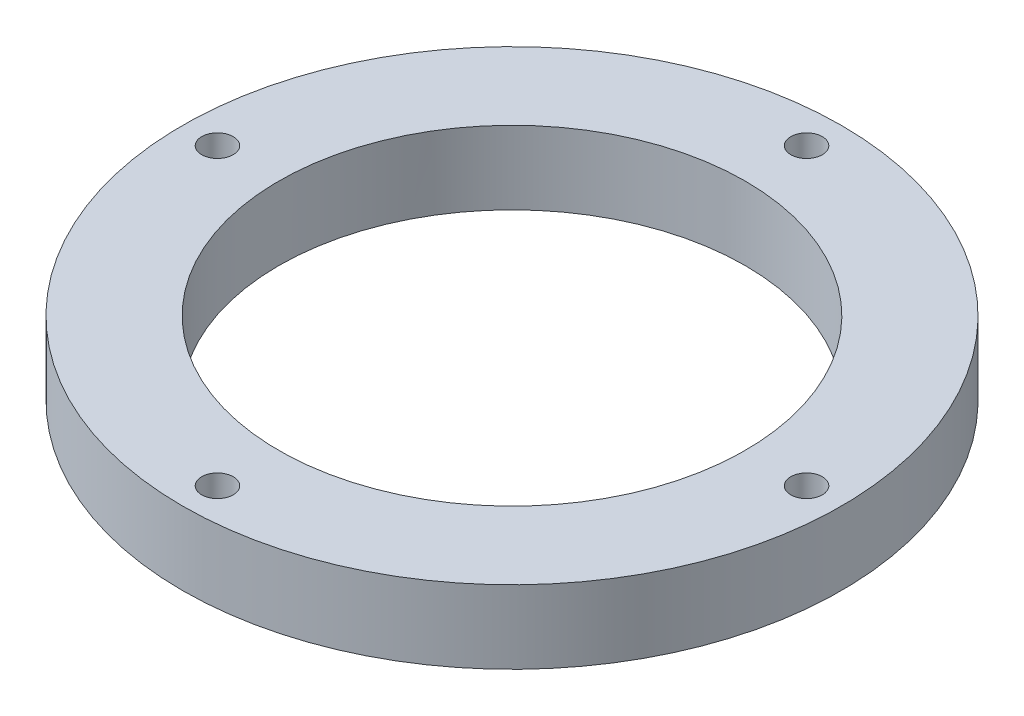
ISO-10303-21;
HEADER;
FILE_DESCRIPTION(('STEP AP214'),'2;1');
FILE_NAME('part.step','',(''),(''),'','','');
FILE_SCHEMA(('AUTOMOTIVE_DESIGN { 1 0 10303 214 1 1 1 1 }'));
ENDSEC;
DATA;
#1=APPLICATION_CONTEXT('core data for automotive mechanical design processes');
#2=APPLICATION_PROTOCOL_DEFINITION('international standard','automotive_design',2000,#1);
#3=PRODUCT_CONTEXT('',#1,'mechanical');
#4=PRODUCT('Part','Part','',(#3));
#5=PRODUCT_RELATED_PRODUCT_CATEGORY('part','',(#4));
#6=PRODUCT_DEFINITION_FORMATION('','',#4);
#7=PRODUCT_DEFINITION_CONTEXT('part definition',#1,'design');
#8=PRODUCT_DEFINITION('design','',#6,#7);
#9=PRODUCT_DEFINITION_SHAPE('','',#8);
#10=(LENGTH_UNIT() NAMED_UNIT(*) SI_UNIT(.MILLI.,.METRE.));
#11=(NAMED_UNIT(*) PLANE_ANGLE_UNIT() SI_UNIT($,.RADIAN.));
#12=(NAMED_UNIT(*) SI_UNIT($,.STERADIAN.) SOLID_ANGLE_UNIT());
#13=UNCERTAINTY_MEASURE_WITH_UNIT(LENGTH_MEASURE(1.E-05),#10,'distance_accuracy_value','');
#14=(GEOMETRIC_REPRESENTATION_CONTEXT(3) GLOBAL_UNCERTAINTY_ASSIGNED_CONTEXT((#13)) GLOBAL_UNIT_ASSIGNED_CONTEXT((#10,
#11,#12)) REPRESENTATION_CONTEXT('',''));
#15=CARTESIAN_POINT('',(0.,0.,0.));
#16=DIRECTION('',(0.,0.,1.));
#17=DIRECTION('',(1.,0.,0.));
#18=AXIS2_PLACEMENT_3D('',#15,#16,#17);
#19=CARTESIAN_POINT('',(0.,-10.,0.));
#20=DIRECTION('',(0.,1.,0.));
#21=DIRECTION('',(0.,0.,1.));
#22=AXIS2_PLACEMENT_3D('',#19,#20,#21);
#23=CYLINDRICAL_SURFACE('',#22,45.);
#24=CARTESIAN_POINT('',(0.,-10.,0.));
#25=DIRECTION('',(0.,1.,0.));
#26=DIRECTION('',(0.,0.,1.));
#27=AXIS2_PLACEMENT_3D('',#24,#25,#26);
#28=CIRCLE('',#27,45.);
#29=CARTESIAN_POINT('',(0.,-10.,45.));
#30=VERTEX_POINT('',#29);
#31=EDGE_CURVE('E10',#30,#30,#28,.T.);
#32=ORIENTED_EDGE('',*,*,#31,.T.);
#33=EDGE_LOOP('',(#32));
#34=FACE_BOUND('',#33,.T.);
#35=CARTESIAN_POINT('',(0.,0.,0.));
#36=DIRECTION('',(0.,1.,0.));
#37=DIRECTION('',(0.,0.,1.));
#38=AXIS2_PLACEMENT_3D('',#35,#36,#37);
#39=CIRCLE('',#38,45.);
#40=CARTESIAN_POINT('',(0.,0.,45.));
#41=VERTEX_POINT('',#40);
#42=EDGE_CURVE('E40',#41,#41,#39,.T.);
#43=ORIENTED_EDGE('',*,*,#42,.F.);
#44=EDGE_LOOP('',(#43));
#45=FACE_BOUND('',#44,.T.);
#46=ADVANCED_FACE('F37',(#34,#45),#23,.T.);
#47=CARTESIAN_POINT('',(0.,-10.,0.));
#48=DIRECTION('',(0.,1.,0.));
#49=DIRECTION('',(0.,0.,1.));
#50=AXIS2_PLACEMENT_3D('',#47,#48,#49);
#51=PLANE('',#50);
#52=CARTESIAN_POINT('',(-40.22,-10.,0.));
#53=DIRECTION('',(0.,-1.,0.));
#54=DIRECTION('',(0.,0.,-1.));
#55=AXIS2_PLACEMENT_3D('',#52,#53,#54);
#56=CIRCLE('',#55,2.15);
#57=CARTESIAN_POINT('',(-40.22,-10.,-2.15));
#58=VERTEX_POINT('',#57);
#59=EDGE_CURVE('E83',#58,#58,#56,.T.);
#60=ORIENTED_EDGE('',*,*,#59,.F.);
#61=EDGE_LOOP('',(#60));
#62=FACE_BOUND('',#61,.T.);
#63=CARTESIAN_POINT('',(0.,-10.,-40.22));
#64=DIRECTION('',(0.,-1.,0.));
#65=DIRECTION('',(0.,0.,-1.));
#66=AXIS2_PLACEMENT_3D('',#63,#64,#65);
#67=CIRCLE('',#66,2.15);
#68=CARTESIAN_POINT('',(0.,-10.,-42.37));
#69=VERTEX_POINT('',#68);
#70=EDGE_CURVE('E75',#69,#69,#67,.T.);
#71=ORIENTED_EDGE('',*,*,#70,.F.);
#72=EDGE_LOOP('',(#71));
#73=FACE_BOUND('',#72,.T.);
#74=CARTESIAN_POINT('',(0.,-10.,40.22));
#75=DIRECTION('',(0.,-1.,0.));
#76=DIRECTION('',(0.,0.,-1.));
#77=AXIS2_PLACEMENT_3D('',#74,#75,#76);
#78=CIRCLE('',#77,2.15);
#79=CARTESIAN_POINT('',(0.,-10.,38.07));
#80=VERTEX_POINT('',#79);
#81=EDGE_CURVE('E67',#80,#80,#78,.T.);
#82=ORIENTED_EDGE('',*,*,#81,.F.);
#83=EDGE_LOOP('',(#82));
#84=FACE_BOUND('',#83,.T.);
#85=CARTESIAN_POINT('',(40.22,-10.,0.));
#86=DIRECTION('',(0.,-1.,0.));
#87=DIRECTION('',(0.,0.,-1.));
#88=AXIS2_PLACEMENT_3D('',#85,#86,#87);
#89=CIRCLE('',#88,2.15);
#90=CARTESIAN_POINT('',(40.22,-10.,-2.15));
#91=VERTEX_POINT('',#90);
#92=EDGE_CURVE('E59',#91,#91,#89,.T.);
#93=ORIENTED_EDGE('',*,*,#92,.F.);
#94=EDGE_LOOP('',(#93));
#95=FACE_BOUND('',#94,.T.);
#96=CARTESIAN_POINT('',(0.,-10.,0.));
#97=DIRECTION('',(0.,1.,0.));
#98=DIRECTION('',(0.,0.,1.));
#99=AXIS2_PLACEMENT_3D('',#96,#97,#98);
#100=CIRCLE('',#99,31.85);
#101=CARTESIAN_POINT('',(0.,-10.,31.85));
#102=VERTEX_POINT('',#101);
#103=EDGE_CURVE('E49',#102,#102,#100,.T.);
#104=ORIENTED_EDGE('',*,*,#103,.T.);
#105=EDGE_LOOP('',(#104));
#106=FACE_BOUND('',#105,.T.);
#107=ORIENTED_EDGE('',*,*,#31,.F.);
#108=EDGE_LOOP('',(#107));
#109=FACE_BOUND('',#108,.T.);
#110=ADVANCED_FACE('F101',(#62,#73,#84,#95,#106,#109),#51,.F.);
#111=CARTESIAN_POINT('',(0.,0.,0.));
#112=DIRECTION('',(0.,1.,0.));
#113=DIRECTION('',(0.,0.,1.));
#114=AXIS2_PLACEMENT_3D('',#111,#112,#113);
#115=PLANE('',#114);
#116=CARTESIAN_POINT('',(-40.22,0.,0.));
#117=DIRECTION('',(0.,-1.,0.));
#118=DIRECTION('',(0.,0.,-1.));
#119=AXIS2_PLACEMENT_3D('',#116,#117,#118);
#120=CIRCLE('',#119,2.15);
#121=CARTESIAN_POINT('',(-40.22,0.,-2.15));
#122=VERTEX_POINT('',#121);
#123=EDGE_CURVE('E58',#122,#122,#120,.T.);
#124=ORIENTED_EDGE('',*,*,#123,.T.);
#125=EDGE_LOOP('',(#124));
#126=FACE_BOUND('',#125,.T.);
#127=CARTESIAN_POINT('',(0.,0.,-40.22));
#128=DIRECTION('',(0.,-1.,0.));
#129=DIRECTION('',(0.,0.,-1.));
#130=AXIS2_PLACEMENT_3D('',#127,#128,#129);
#131=CIRCLE('',#130,2.15);
#132=CARTESIAN_POINT('',(0.,0.,-42.37));
#133=VERTEX_POINT('',#132);
#134=EDGE_CURVE('E79',#133,#133,#131,.T.);
#135=ORIENTED_EDGE('',*,*,#134,.T.);
#136=EDGE_LOOP('',(#135));
#137=FACE_BOUND('',#136,.T.);
#138=CARTESIAN_POINT('',(0.,0.,40.22));
#139=DIRECTION('',(0.,-1.,0.));
#140=DIRECTION('',(0.,0.,-1.));
#141=AXIS2_PLACEMENT_3D('',#138,#139,#140);
#142=CIRCLE('',#141,2.15);
#143=CARTESIAN_POINT('',(0.,0.,38.07));
#144=VERTEX_POINT('',#143);
#145=EDGE_CURVE('E71',#144,#144,#142,.T.);
#146=ORIENTED_EDGE('',*,*,#145,.T.);
#147=EDGE_LOOP('',(#146));
#148=FACE_BOUND('',#147,.T.);
#149=CARTESIAN_POINT('',(40.22,0.,0.));
#150=DIRECTION('',(0.,-1.,0.));
#151=DIRECTION('',(0.,0.,-1.));
#152=AXIS2_PLACEMENT_3D('',#149,#150,#151);
#153=CIRCLE('',#152,2.15);
#154=CARTESIAN_POINT('',(40.22,0.,-2.15));
#155=VERTEX_POINT('',#154);
#156=EDGE_CURVE('E63',#155,#155,#153,.T.);
#157=ORIENTED_EDGE('',*,*,#156,.T.);
#158=EDGE_LOOP('',(#157));
#159=FACE_BOUND('',#158,.T.);
#160=CARTESIAN_POINT('',(0.,0.,0.));
#161=DIRECTION('',(0.,-1.,0.));
#162=DIRECTION('',(0.,0.,-1.));
#163=AXIS2_PLACEMENT_3D('',#160,#161,#162);
#164=CIRCLE('',#163,31.85);
#165=CARTESIAN_POINT('',(0.,0.,-31.85));
#166=VERTEX_POINT('',#165);
#167=EDGE_CURVE('E54',#166,#166,#164,.T.);
#168=ORIENTED_EDGE('',*,*,#167,.T.);
#169=EDGE_LOOP('',(#168));
#170=FACE_BOUND('',#169,.T.);
#171=ORIENTED_EDGE('',*,*,#42,.T.);
#172=EDGE_LOOP('',(#171));
#173=FACE_BOUND('',#172,.T.);
#174=ADVANCED_FACE('F91',(#126,#137,#148,#159,#170,#173),#115,.T.);
#175=CARTESIAN_POINT('',(0.,0.,0.));
#176=DIRECTION('',(0.,-1.,0.));
#177=DIRECTION('',(0.,0.,-1.));
#178=AXIS2_PLACEMENT_3D('',#175,#176,#177);
#179=CYLINDRICAL_SURFACE('',#178,31.85);
#180=ORIENTED_EDGE('',*,*,#167,.F.);
#181=EDGE_LOOP('',(#180));
#182=FACE_BOUND('',#181,.T.);
#183=ORIENTED_EDGE('',*,*,#103,.F.);
#184=EDGE_LOOP('',(#183));
#185=FACE_BOUND('',#184,.T.);
#186=ADVANCED_FACE('F114',(#182,#185),#179,.F.);
#187=CARTESIAN_POINT('',(40.22,0.,0.));
#188=DIRECTION('',(0.,-1.,0.));
#189=DIRECTION('',(0.,0.,-1.));
#190=AXIS2_PLACEMENT_3D('',#187,#188,#189);
#191=CYLINDRICAL_SURFACE('',#190,2.15);
#192=ORIENTED_EDGE('',*,*,#156,.F.);
#193=EDGE_LOOP('',(#192));
#194=FACE_BOUND('',#193,.T.);
#195=ORIENTED_EDGE('',*,*,#92,.T.);
#196=EDGE_LOOP('',(#195));
#197=FACE_BOUND('',#196,.T.);
#198=ADVANCED_FACE('F116',(#194,#197),#191,.F.);
#199=CARTESIAN_POINT('',(0.,0.,40.22));
#200=DIRECTION('',(0.,-1.,0.));
#201=DIRECTION('',(0.,0.,-1.));
#202=AXIS2_PLACEMENT_3D('',#199,#200,#201);
#203=CYLINDRICAL_SURFACE('',#202,2.15);
#204=ORIENTED_EDGE('',*,*,#145,.F.);
#205=EDGE_LOOP('',(#204));
#206=FACE_BOUND('',#205,.T.);
#207=ORIENTED_EDGE('',*,*,#81,.T.);
#208=EDGE_LOOP('',(#207));
#209=FACE_BOUND('',#208,.T.);
#210=ADVANCED_FACE('F123',(#206,#209),#203,.F.);
#211=CARTESIAN_POINT('',(0.,0.,-40.22));
#212=DIRECTION('',(0.,-1.,0.));
#213=DIRECTION('',(0.,0.,-1.));
#214=AXIS2_PLACEMENT_3D('',#211,#212,#213);
#215=CYLINDRICAL_SURFACE('',#214,2.15);
#216=ORIENTED_EDGE('',*,*,#134,.F.);
#217=EDGE_LOOP('',(#216));
#218=FACE_BOUND('',#217,.T.);
#219=ORIENTED_EDGE('',*,*,#70,.T.);
#220=EDGE_LOOP('',(#219));
#221=FACE_BOUND('',#220,.T.);
#222=ADVANCED_FACE('F97',(#218,#221),#215,.F.);
#223=CARTESIAN_POINT('',(-40.22,0.,0.));
#224=DIRECTION('',(0.,-1.,0.));
#225=DIRECTION('',(0.,0.,-1.));
#226=AXIS2_PLACEMENT_3D('',#223,#224,#225);
#227=CYLINDRICAL_SURFACE('',#226,2.15);
#228=ORIENTED_EDGE('',*,*,#123,.F.);
#229=EDGE_LOOP('',(#228));
#230=FACE_BOUND('',#229,.T.);
#231=ORIENTED_EDGE('',*,*,#59,.T.);
#232=EDGE_LOOP('',(#231));
#233=FACE_BOUND('',#232,.T.);
#234=ADVANCED_FACE('F94',(#230,#233),#227,.F.);
#235=CLOSED_SHELL('',(#46,#110,#174,#186,#198,#210,#222,#234));
#236=MANIFOLD_SOLID_BREP('B2',#235);
#237=ADVANCED_BREP_SHAPE_REPRESENTATION('',(#18,#236),#14);
#238=SHAPE_DEFINITION_REPRESENTATION(#9,#237);
ENDSEC;
END-ISO-10303-21;
